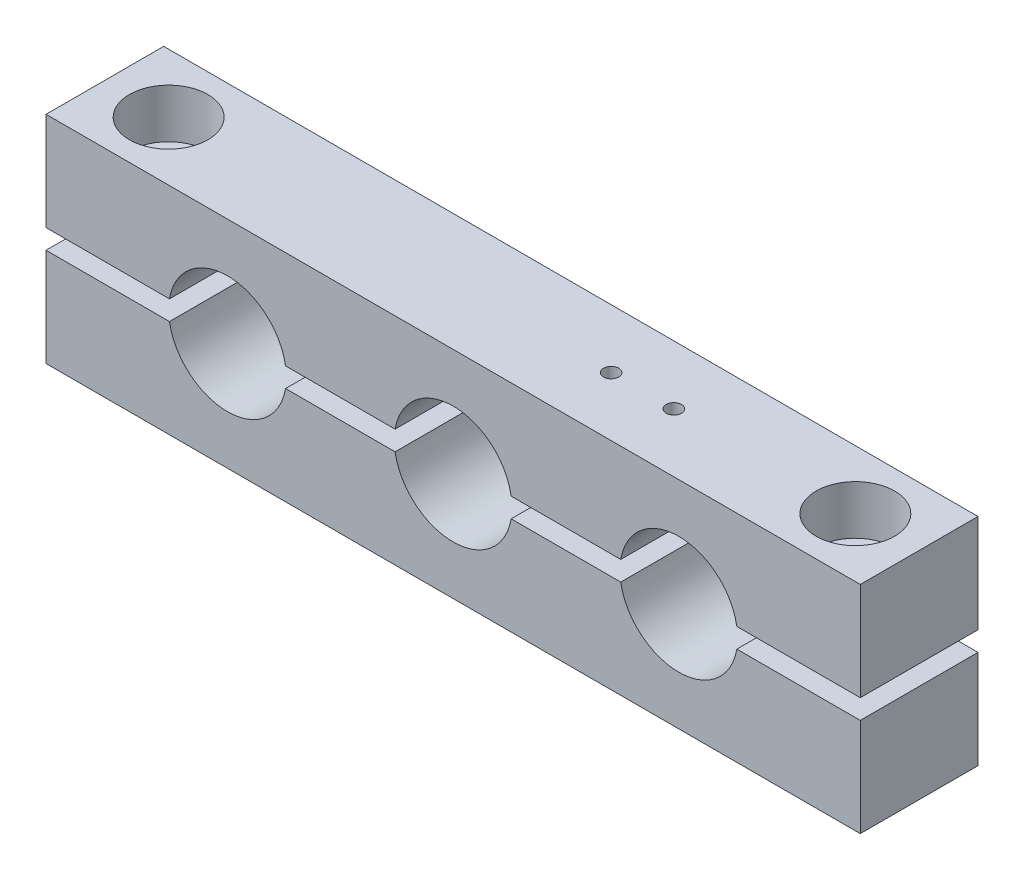
ISO-10303-21;
HEADER;
FILE_DESCRIPTION(('STEP AP214'),'2;1');
FILE_NAME('part.step','',(''),(''),'','','');
FILE_SCHEMA(('AUTOMOTIVE_DESIGN { 1 0 10303 214 1 1 1 1 }'));
ENDSEC;
DATA;
#1=APPLICATION_CONTEXT('core data for automotive mechanical design processes');
#2=APPLICATION_PROTOCOL_DEFINITION('international standard','automotive_design',2000,#1);
#3=PRODUCT_CONTEXT('',#1,'mechanical');
#4=PRODUCT('Part','Part','',(#3));
#5=PRODUCT_RELATED_PRODUCT_CATEGORY('part','',(#4));
#6=PRODUCT_DEFINITION_FORMATION('','',#4);
#7=PRODUCT_DEFINITION_CONTEXT('part definition',#1,'design');
#8=PRODUCT_DEFINITION('design','',#6,#7);
#9=PRODUCT_DEFINITION_SHAPE('','',#8);
#10=(LENGTH_UNIT() NAMED_UNIT(*) SI_UNIT(.MILLI.,.METRE.));
#11=(NAMED_UNIT(*) PLANE_ANGLE_UNIT() SI_UNIT($,.RADIAN.));
#12=(NAMED_UNIT(*) SI_UNIT($,.STERADIAN.) SOLID_ANGLE_UNIT());
#13=UNCERTAINTY_MEASURE_WITH_UNIT(LENGTH_MEASURE(1.E-05),#10,'distance_accuracy_value','');
#14=(GEOMETRIC_REPRESENTATION_CONTEXT(3) GLOBAL_UNCERTAINTY_ASSIGNED_CONTEXT((#13)) GLOBAL_UNIT_ASSIGNED_CONTEXT((#10,
#11,#12)) REPRESENTATION_CONTEXT('',''));
#15=CARTESIAN_POINT('',(0.,0.,0.));
#16=DIRECTION('',(0.,0.,1.));
#17=DIRECTION('',(1.,0.,0.));
#18=AXIS2_PLACEMENT_3D('',#15,#16,#17);
#19=CARTESIAN_POINT('',(35.,-11.,6.));
#20=DIRECTION('',(0.,1.,0.));
#21=DIRECTION('',(0.,0.,1.));
#22=AXIS2_PLACEMENT_3D('',#19,#20,#21);
#23=CYLINDRICAL_SURFACE('',#22,2.1);
#24=CARTESIAN_POINT('',(35.,0.999999999999999,6.));
#25=DIRECTION('',(0.,1.,0.));
#26=DIRECTION('',(0.,0.,1.));
#27=AXIS2_PLACEMENT_3D('',#24,#25,#26);
#28=CIRCLE('',#27,2.1);
#29=CARTESIAN_POINT('',(35.,0.999999999999999,8.1));
#30=VERTEX_POINT('',#29);
#31=EDGE_CURVE('E189',#30,#30,#28,.F.);
#32=ORIENTED_EDGE('',*,*,#31,.T.);
#33=EDGE_LOOP('',(#32));
#34=FACE_BOUND('',#33,.T.);
#35=CARTESIAN_POINT('',(35.,6.,6.));
#36=DIRECTION('',(0.,1.,0.));
#37=DIRECTION('',(0.,0.,1.));
#38=AXIS2_PLACEMENT_3D('',#35,#36,#37);
#39=CIRCLE('',#38,2.1);
#40=CARTESIAN_POINT('',(35.,6.,8.1));
#41=VERTEX_POINT('',#40);
#42=EDGE_CURVE('E217',#41,#41,#39,.F.);
#43=ORIENTED_EDGE('',*,*,#42,.F.);
#44=EDGE_LOOP('',(#43));
#45=FACE_BOUND('',#44,.T.);
#46=ADVANCED_FACE('F46',(#34,#45),#23,.F.);
#47=CARTESIAN_POINT('',(-35.,-11.,6.));
#48=DIRECTION('',(0.,1.,0.));
#49=DIRECTION('',(0.,0.,1.));
#50=AXIS2_PLACEMENT_3D('',#47,#48,#49);
#51=CYLINDRICAL_SURFACE('',#50,2.1);
#52=CARTESIAN_POINT('',(-35.,0.999999999999999,6.));
#53=DIRECTION('',(0.,1.,0.));
#54=DIRECTION('',(0.,0.,1.));
#55=AXIS2_PLACEMENT_3D('',#52,#53,#54);
#56=CIRCLE('',#55,2.1);
#57=CARTESIAN_POINT('',(-35.,0.999999999999999,8.1));
#58=VERTEX_POINT('',#57);
#59=EDGE_CURVE('E192',#58,#58,#56,.F.);
#60=ORIENTED_EDGE('',*,*,#59,.T.);
#61=EDGE_LOOP('',(#60));
#62=FACE_BOUND('',#61,.T.);
#63=CARTESIAN_POINT('',(-35.,6.,6.));
#64=DIRECTION('',(0.,1.,0.));
#65=DIRECTION('',(0.,0.,1.));
#66=AXIS2_PLACEMENT_3D('',#63,#64,#65);
#67=CIRCLE('',#66,2.1);
#68=CARTESIAN_POINT('',(-35.,6.,8.1));
#69=VERTEX_POINT('',#68);
#70=EDGE_CURVE('E179',#69,#69,#67,.F.);
#71=ORIENTED_EDGE('',*,*,#70,.F.);
#72=EDGE_LOOP('',(#71));
#73=FACE_BOUND('',#72,.T.);
#74=ADVANCED_FACE('F273',(#62,#73),#51,.F.);
#75=CARTESIAN_POINT('',(0.,0.,12.));
#76=DIRECTION('',(0.,0.,-1.));
#77=DIRECTION('',(-1.,0.,0.));
#78=AXIS2_PLACEMENT_3D('',#75,#76,#77);
#79=PLANE('',#78);
#80=DIRECTION('',(0.,-1.,0.));
#81=VECTOR('',#80,1.);
#82=CARTESIAN_POINT('',(-41.5,-11.,12.));
#83=LINE('',#82,#81);
#84=CARTESIAN_POINT('',(-41.5,11.,12.));
#85=VERTEX_POINT('',#84);
#86=CARTESIAN_POINT('',(-41.5,1.,12.));
#87=VERTEX_POINT('',#86);
#88=EDGE_CURVE('E196',#85,#87,#83,.T.);
#89=ORIENTED_EDGE('',*,*,#88,.T.);
#90=DIRECTION('',(-1.,0.,0.));
#91=VECTOR('',#90,1.);
#92=CARTESIAN_POINT('',(-48.1191983947229,1.,12.));
#93=LINE('',#92,#91);
#94=CARTESIAN_POINT('',(-28.9160797830996,1.,12.));
#95=VERTEX_POINT('',#94);
#96=EDGE_CURVE('E130',#95,#87,#93,.T.);
#97=ORIENTED_EDGE('',*,*,#96,.F.);
#98=CARTESIAN_POINT('',(-23.,0.,12.));
#99=DIRECTION('',(0.,0.,1.));
#100=DIRECTION('',(1.,0.,0.));
#101=AXIS2_PLACEMENT_3D('',#98,#99,#100);
#102=CIRCLE('',#101,6.);
#103=CARTESIAN_POINT('',(-17.0839202169004,1.,12.));
#104=VERTEX_POINT('',#103);
#105=EDGE_CURVE('E166',#104,#95,#102,.T.);
#106=ORIENTED_EDGE('',*,*,#105,.F.);
#107=CARTESIAN_POINT('',(-5.91607978309963,1.,12.));
#108=VERTEX_POINT('',#107);
#109=EDGE_CURVE('E56',#108,#104,#93,.T.);
#110=ORIENTED_EDGE('',*,*,#109,.F.);
#111=CARTESIAN_POINT('',(0.,0.,12.));
#112=DIRECTION('',(0.,0.,1.));
#113=DIRECTION('',(1.,0.,0.));
#114=AXIS2_PLACEMENT_3D('',#111,#112,#113);
#115=CIRCLE('',#114,6.);
#116=CARTESIAN_POINT('',(5.91607978309961,1.,12.));
#117=VERTEX_POINT('',#116);
#118=EDGE_CURVE('E163',#117,#108,#115,.T.);
#119=ORIENTED_EDGE('',*,*,#118,.F.);
#120=CARTESIAN_POINT('',(17.0839202169004,1.,12.));
#121=VERTEX_POINT('',#120);
#122=EDGE_CURVE('E247',#121,#117,#93,.T.);
#123=ORIENTED_EDGE('',*,*,#122,.F.);
#124=CARTESIAN_POINT('',(23.,0.,12.));
#125=DIRECTION('',(0.,0.,1.));
#126=DIRECTION('',(-1.,0.,0.));
#127=AXIS2_PLACEMENT_3D('',#124,#125,#126);
#128=CIRCLE('',#127,5.99999999999999);
#129=CARTESIAN_POINT('',(28.9160797830996,1.,12.));
#130=VERTEX_POINT('',#129);
#131=EDGE_CURVE('E172',#130,#121,#128,.T.);
#132=ORIENTED_EDGE('',*,*,#131,.F.);
#133=CARTESIAN_POINT('',(41.5,1.,12.));
#134=VERTEX_POINT('',#133);
#135=EDGE_CURVE('E207',#134,#130,#93,.T.);
#136=ORIENTED_EDGE('',*,*,#135,.F.);
#137=DIRECTION('',(0.,1.,0.));
#138=VECTOR('',#137,1.);
#139=CARTESIAN_POINT('',(41.5,-11.,12.));
#140=LINE('',#139,#138);
#141=CARTESIAN_POINT('',(41.5,11.,12.));
#142=VERTEX_POINT('',#141);
#143=EDGE_CURVE('E158',#134,#142,#140,.T.);
#144=ORIENTED_EDGE('',*,*,#143,.T.);
#145=DIRECTION('',(-1.,0.,0.));
#146=VECTOR('',#145,1.);
#147=CARTESIAN_POINT('',(-41.5,11.,12.));
#148=LINE('',#147,#146);
#149=EDGE_CURVE('E146',#142,#85,#148,.T.);
#150=ORIENTED_EDGE('',*,*,#149,.T.);
#151=EDGE_LOOP('',(#89,#97,#106,#110,#119,#123,#132,#136,#144,#150));
#152=FACE_BOUND('',#151,.T.);
#153=ADVANCED_FACE('F48',(#152),#79,.F.);
#154=CARTESIAN_POINT('',(0.,0.,0.));
#155=DIRECTION('',(0.,0.,-1.));
#156=DIRECTION('',(-1.,0.,0.));
#157=AXIS2_PLACEMENT_3D('',#154,#155,#156);
#158=PLANE('',#157);
#159=DIRECTION('',(-1.,0.,0.));
#160=VECTOR('',#159,1.);
#161=CARTESIAN_POINT('',(-48.1191983947229,1.,0.));
#162=LINE('',#161,#160);
#163=CARTESIAN_POINT('',(-28.9160797830996,1.,0.));
#164=VERTEX_POINT('',#163);
#165=CARTESIAN_POINT('',(-41.5,1.,0.));
#166=VERTEX_POINT('',#165);
#167=EDGE_CURVE('E127',#164,#166,#162,.T.);
#168=ORIENTED_EDGE('',*,*,#167,.T.);
#169=DIRECTION('',(0.,-1.,0.));
#170=VECTOR('',#169,1.);
#171=CARTESIAN_POINT('',(-41.5,-11.,0.));
#172=LINE('',#171,#170);
#173=CARTESIAN_POINT('',(-41.5,11.,0.));
#174=VERTEX_POINT('',#173);
#175=EDGE_CURVE('E136',#174,#166,#172,.T.);
#176=ORIENTED_EDGE('',*,*,#175,.F.);
#177=DIRECTION('',(-1.,0.,0.));
#178=VECTOR('',#177,1.);
#179=CARTESIAN_POINT('',(-41.5,11.,0.));
#180=LINE('',#179,#178);
#181=CARTESIAN_POINT('',(41.5,11.,0.));
#182=VERTEX_POINT('',#181);
#183=EDGE_CURVE('E154',#182,#174,#180,.T.);
#184=ORIENTED_EDGE('',*,*,#183,.F.);
#185=DIRECTION('',(0.,1.,0.));
#186=VECTOR('',#185,1.);
#187=CARTESIAN_POINT('',(41.5,-11.,0.));
#188=LINE('',#187,#186);
#189=CARTESIAN_POINT('',(41.5,1.,0.));
#190=VERTEX_POINT('',#189);
#191=EDGE_CURVE('E160',#190,#182,#188,.T.);
#192=ORIENTED_EDGE('',*,*,#191,.F.);
#193=CARTESIAN_POINT('',(28.9160797830996,1.,0.));
#194=VERTEX_POINT('',#193);
#195=EDGE_CURVE('E145',#190,#194,#162,.T.);
#196=ORIENTED_EDGE('',*,*,#195,.T.);
#197=CARTESIAN_POINT('',(23.,0.,0.));
#198=DIRECTION('',(0.,0.,1.));
#199=DIRECTION('',(-1.,0.,0.));
#200=AXIS2_PLACEMENT_3D('',#197,#198,#199);
#201=CIRCLE('',#200,5.99999999999999);
#202=CARTESIAN_POINT('',(17.0839202169004,1.,0.));
#203=VERTEX_POINT('',#202);
#204=EDGE_CURVE('E50',#194,#203,#201,.T.);
#205=ORIENTED_EDGE('',*,*,#204,.T.);
#206=CARTESIAN_POINT('',(5.91607978309961,1.,0.));
#207=VERTEX_POINT('',#206);
#208=EDGE_CURVE('E103',#203,#207,#162,.T.);
#209=ORIENTED_EDGE('',*,*,#208,.T.);
#210=CARTESIAN_POINT('',(0.,0.,0.));
#211=DIRECTION('',(0.,0.,1.));
#212=DIRECTION('',(1.,0.,0.));
#213=AXIS2_PLACEMENT_3D('',#210,#211,#212);
#214=CIRCLE('',#213,6.);
#215=CARTESIAN_POINT('',(-5.91607978309963,1.,0.));
#216=VERTEX_POINT('',#215);
#217=EDGE_CURVE('E167',#207,#216,#214,.T.);
#218=ORIENTED_EDGE('',*,*,#217,.T.);
#219=CARTESIAN_POINT('',(-17.0839202169004,1.,0.));
#220=VERTEX_POINT('',#219);
#221=EDGE_CURVE('E64',#216,#220,#162,.T.);
#222=ORIENTED_EDGE('',*,*,#221,.T.);
#223=CARTESIAN_POINT('',(-23.,0.,0.));
#224=DIRECTION('',(0.,0.,1.));
#225=DIRECTION('',(1.,0.,0.));
#226=AXIS2_PLACEMENT_3D('',#223,#224,#225);
#227=CIRCLE('',#226,6.);
#228=EDGE_CURVE('E144',#220,#164,#227,.T.);
#229=ORIENTED_EDGE('',*,*,#228,.T.);
#230=EDGE_LOOP('',(#168,#176,#184,#192,#196,#205,#209,#218,#222,#229));
#231=FACE_BOUND('',#230,.T.);
#232=ADVANCED_FACE('F141',(#231),#158,.T.);
#233=CARTESIAN_POINT('',(41.5,-11.,12.));
#234=DIRECTION('',(-1.,0.,0.));
#235=DIRECTION('',(0.,0.,1.));
#236=AXIS2_PLACEMENT_3D('',#233,#234,#235);
#237=PLANE('',#236);
#238=ORIENTED_EDGE('',*,*,#143,.F.);
#239=DIRECTION('',(0.,0.,-1.));
#240=VECTOR('',#239,1.);
#241=CARTESIAN_POINT('',(41.5,0.999999999999999,12.));
#242=LINE('',#241,#240);
#243=EDGE_CURVE('E162',#134,#190,#242,.T.);
#244=ORIENTED_EDGE('',*,*,#243,.T.);
#245=ORIENTED_EDGE('',*,*,#191,.T.);
#246=DIRECTION('',(0.,0.,-1.));
#247=VECTOR('',#246,1.);
#248=CARTESIAN_POINT('',(41.5,11.,12.));
#249=LINE('',#248,#247);
#250=EDGE_CURVE('E151',#142,#182,#249,.T.);
#251=ORIENTED_EDGE('',*,*,#250,.F.);
#252=EDGE_LOOP('',(#238,#244,#245,#251));
#253=FACE_BOUND('',#252,.T.);
#254=ADVANCED_FACE('F232',(#253),#237,.F.);
#255=CARTESIAN_POINT('',(-41.5,11.,12.));
#256=DIRECTION('',(0.,-1.,0.));
#257=DIRECTION('',(0.,0.,-1.));
#258=AXIS2_PLACEMENT_3D('',#255,#256,#257);
#259=PLANE('',#258);
#260=CARTESIAN_POINT('',(16.5,11.,6.));
#261=DIRECTION('',(0.,1.,0.));
#262=DIRECTION('',(0.,0.,1.));
#263=AXIS2_PLACEMENT_3D('',#260,#261,#262);
#264=CIRCLE('',#263,0.779999999999999);
#265=CARTESIAN_POINT('',(16.5,11.,6.78));
#266=VERTEX_POINT('',#265);
#267=EDGE_CURVE('E317',#266,#266,#264,.T.);
#268=ORIENTED_EDGE('',*,*,#267,.F.);
#269=EDGE_LOOP('',(#268));
#270=FACE_BOUND('',#269,.T.);
#271=CARTESIAN_POINT('',(10.1,11.,6.00000000000001));
#272=DIRECTION('',(0.,1.,0.));
#273=DIRECTION('',(0.,0.,1.));
#274=AXIS2_PLACEMENT_3D('',#271,#272,#273);
#275=CIRCLE('',#274,0.779999999999999);
#276=CARTESIAN_POINT('',(10.1,11.,6.78));
#277=VERTEX_POINT('',#276);
#278=EDGE_CURVE('E325',#277,#277,#275,.T.);
#279=ORIENTED_EDGE('',*,*,#278,.F.);
#280=EDGE_LOOP('',(#279));
#281=FACE_BOUND('',#280,.T.);
#282=CARTESIAN_POINT('',(-35.,11.,6.));
#283=DIRECTION('',(0.,1.,0.));
#284=DIRECTION('',(0.,0.,1.));
#285=AXIS2_PLACEMENT_3D('',#282,#283,#284);
#286=CIRCLE('',#285,4.);
#287=CARTESIAN_POINT('',(-35.,11.,10.));
#288=VERTEX_POINT('',#287);
#289=EDGE_CURVE('E184',#288,#288,#286,.T.);
#290=ORIENTED_EDGE('',*,*,#289,.F.);
#291=EDGE_LOOP('',(#290));
#292=FACE_BOUND('',#291,.T.);
#293=CARTESIAN_POINT('',(35.,11.,6.));
#294=DIRECTION('',(0.,1.,0.));
#295=DIRECTION('',(0.,0.,1.));
#296=AXIS2_PLACEMENT_3D('',#293,#294,#295);
#297=CIRCLE('',#296,4.00000000000001);
#298=CARTESIAN_POINT('',(35.,11.,10.));
#299=VERTEX_POINT('',#298);
#300=EDGE_CURVE('E201',#299,#299,#297,.T.);
#301=ORIENTED_EDGE('',*,*,#300,.F.);
#302=EDGE_LOOP('',(#301));
#303=FACE_BOUND('',#302,.T.);
#304=ORIENTED_EDGE('',*,*,#183,.T.);
#305=DIRECTION('',(0.,0.,-1.));
#306=VECTOR('',#305,1.);
#307=CARTESIAN_POINT('',(-41.5,11.,12.));
#308=LINE('',#307,#306);
#309=EDGE_CURVE('E135',#85,#174,#308,.T.);
#310=ORIENTED_EDGE('',*,*,#309,.F.);
#311=ORIENTED_EDGE('',*,*,#149,.F.);
#312=ORIENTED_EDGE('',*,*,#250,.T.);
#313=EDGE_LOOP('',(#304,#310,#311,#312));
#314=FACE_BOUND('',#313,.T.);
#315=ADVANCED_FACE('F229',(#270,#281,#292,#303,#314),#259,.F.);
#316=CARTESIAN_POINT('',(-41.5,-11.,12.));
#317=DIRECTION('',(1.,0.,0.));
#318=DIRECTION('',(0.,0.,-1.));
#319=AXIS2_PLACEMENT_3D('',#316,#317,#318);
#320=PLANE('',#319);
#321=ORIENTED_EDGE('',*,*,#175,.T.);
#322=DIRECTION('',(0.,0.,1.));
#323=VECTOR('',#322,1.);
#324=CARTESIAN_POINT('',(-41.5,0.999999999999999,12.));
#325=LINE('',#324,#323);
#326=EDGE_CURVE('E123',#166,#87,#325,.T.);
#327=ORIENTED_EDGE('',*,*,#326,.T.);
#328=ORIENTED_EDGE('',*,*,#88,.F.);
#329=ORIENTED_EDGE('',*,*,#309,.T.);
#330=EDGE_LOOP('',(#321,#327,#328,#329));
#331=FACE_BOUND('',#330,.T.);
#332=ADVANCED_FACE('F149',(#331),#320,.F.);
#333=CARTESIAN_POINT('',(0.,0.,12.));
#334=DIRECTION('',(0.,0.,-1.));
#335=DIRECTION('',(-1.,0.,0.));
#336=AXIS2_PLACEMENT_3D('',#333,#334,#335);
#337=CYLINDRICAL_SURFACE('',#336,6.);
#338=DIRECTION('',(0.,0.,-1.));
#339=VECTOR('',#338,1.);
#340=CARTESIAN_POINT('',(5.91607978309961,1.,12.));
#341=LINE('',#340,#339);
#342=EDGE_CURVE('E199',#117,#207,#341,.T.);
#343=ORIENTED_EDGE('',*,*,#342,.F.);
#344=ORIENTED_EDGE('',*,*,#118,.T.);
#345=DIRECTION('',(0.,0.,-1.));
#346=VECTOR('',#345,1.);
#347=CARTESIAN_POINT('',(-5.91607978309963,1.,12.));
#348=LINE('',#347,#346);
#349=EDGE_CURVE('E202',#216,#108,#348,.F.);
#350=ORIENTED_EDGE('',*,*,#349,.F.);
#351=ORIENTED_EDGE('',*,*,#217,.F.);
#352=EDGE_LOOP('',(#343,#344,#350,#351));
#353=FACE_BOUND('',#352,.T.);
#354=ADVANCED_FACE('F261',(#353),#337,.F.);
#355=CARTESIAN_POINT('',(-23.,0.,12.));
#356=DIRECTION('',(0.,0.,-1.));
#357=DIRECTION('',(-1.,0.,0.));
#358=AXIS2_PLACEMENT_3D('',#355,#356,#357);
#359=CYLINDRICAL_SURFACE('',#358,6.);
#360=DIRECTION('',(0.,0.,-1.));
#361=VECTOR('',#360,1.);
#362=CARTESIAN_POINT('',(-17.0839202169004,1.,12.));
#363=LINE('',#362,#361);
#364=EDGE_CURVE('E12',#104,#220,#363,.T.);
#365=ORIENTED_EDGE('',*,*,#364,.F.);
#366=ORIENTED_EDGE('',*,*,#105,.T.);
#367=DIRECTION('',(0.,0.,-1.));
#368=VECTOR('',#367,1.);
#369=CARTESIAN_POINT('',(-28.9160797830996,1.,12.));
#370=LINE('',#369,#368);
#371=EDGE_CURVE('E204',#164,#95,#370,.F.);
#372=ORIENTED_EDGE('',*,*,#371,.F.);
#373=ORIENTED_EDGE('',*,*,#228,.F.);
#374=EDGE_LOOP('',(#365,#366,#372,#373));
#375=FACE_BOUND('',#374,.T.);
#376=ADVANCED_FACE('F258',(#375),#359,.F.);
#377=CARTESIAN_POINT('',(23.,0.,12.));
#378=DIRECTION('',(0.,0.,-1.));
#379=DIRECTION('',(-1.,0.,0.));
#380=AXIS2_PLACEMENT_3D('',#377,#378,#379);
#381=CYLINDRICAL_SURFACE('',#380,5.99999999999999);
#382=DIRECTION('',(0.,0.,-1.));
#383=VECTOR('',#382,1.);
#384=CARTESIAN_POINT('',(28.9160797830996,1.,12.));
#385=LINE('',#384,#383);
#386=EDGE_CURVE('E206',#130,#194,#385,.T.);
#387=ORIENTED_EDGE('',*,*,#386,.F.);
#388=ORIENTED_EDGE('',*,*,#131,.T.);
#389=DIRECTION('',(0.,0.,-1.));
#390=VECTOR('',#389,1.);
#391=CARTESIAN_POINT('',(17.0839202169004,1.,12.));
#392=LINE('',#391,#390);
#393=EDGE_CURVE('E99',#203,#121,#392,.F.);
#394=ORIENTED_EDGE('',*,*,#393,.F.);
#395=ORIENTED_EDGE('',*,*,#204,.F.);
#396=EDGE_LOOP('',(#387,#388,#394,#395));
#397=FACE_BOUND('',#396,.T.);
#398=ADVANCED_FACE('F260',(#397),#381,.F.);
#399=CARTESIAN_POINT('',(-35.,6.,6.));
#400=DIRECTION('',(0.,1.,0.));
#401=DIRECTION('',(0.,0.,1.));
#402=AXIS2_PLACEMENT_3D('',#399,#400,#401);
#403=PLANE('',#402);
#404=CARTESIAN_POINT('',(-35.,6.,6.));
#405=DIRECTION('',(0.,1.,0.));
#406=DIRECTION('',(0.,0.,1.));
#407=AXIS2_PLACEMENT_3D('',#404,#405,#406);
#408=CIRCLE('',#407,4.);
#409=CARTESIAN_POINT('',(-35.,6.,10.));
#410=VERTEX_POINT('',#409);
#411=EDGE_CURVE('E174',#410,#410,#408,.T.);
#412=ORIENTED_EDGE('',*,*,#411,.T.);
#413=EDGE_LOOP('',(#412));
#414=FACE_BOUND('',#413,.T.);
#415=ORIENTED_EDGE('',*,*,#70,.T.);
#416=EDGE_LOOP('',(#415));
#417=FACE_BOUND('',#416,.T.);
#418=ADVANCED_FACE('F267',(#414,#417),#403,.T.);
#419=CARTESIAN_POINT('',(-35.,6.,6.));
#420=DIRECTION('',(0.,1.,0.));
#421=DIRECTION('',(0.,0.,1.));
#422=AXIS2_PLACEMENT_3D('',#419,#420,#421);
#423=CYLINDRICAL_SURFACE('',#422,4.);
#424=ORIENTED_EDGE('',*,*,#411,.F.);
#425=EDGE_LOOP('',(#424));
#426=FACE_BOUND('',#425,.T.);
#427=ORIENTED_EDGE('',*,*,#289,.T.);
#428=EDGE_LOOP('',(#427));
#429=FACE_BOUND('',#428,.T.);
#430=ADVANCED_FACE('F227',(#426,#429),#423,.F.);
#431=CARTESIAN_POINT('',(35.,6.,6.));
#432=DIRECTION('',(0.,1.,0.));
#433=DIRECTION('',(0.,0.,1.));
#434=AXIS2_PLACEMENT_3D('',#431,#432,#433);
#435=PLANE('',#434);
#436=CARTESIAN_POINT('',(35.,6.,6.));
#437=DIRECTION('',(0.,1.,0.));
#438=DIRECTION('',(0.,0.,1.));
#439=AXIS2_PLACEMENT_3D('',#436,#437,#438);
#440=CIRCLE('',#439,4.00000000000001);
#441=CARTESIAN_POINT('',(35.,6.,10.));
#442=VERTEX_POINT('',#441);
#443=EDGE_CURVE('E218',#442,#442,#440,.T.);
#444=ORIENTED_EDGE('',*,*,#443,.T.);
#445=EDGE_LOOP('',(#444));
#446=FACE_BOUND('',#445,.T.);
#447=ORIENTED_EDGE('',*,*,#42,.T.);
#448=EDGE_LOOP('',(#447));
#449=FACE_BOUND('',#448,.T.);
#450=ADVANCED_FACE('F290',(#446,#449),#435,.T.);
#451=CARTESIAN_POINT('',(35.,6.,6.));
#452=DIRECTION('',(0.,1.,0.));
#453=DIRECTION('',(0.,0.,1.));
#454=AXIS2_PLACEMENT_3D('',#451,#452,#453);
#455=CYLINDRICAL_SURFACE('',#454,4.00000000000001);
#456=ORIENTED_EDGE('',*,*,#443,.F.);
#457=EDGE_LOOP('',(#456));
#458=FACE_BOUND('',#457,.T.);
#459=ORIENTED_EDGE('',*,*,#300,.T.);
#460=EDGE_LOOP('',(#459));
#461=FACE_BOUND('',#460,.T.);
#462=ADVANCED_FACE('F294',(#458,#461),#455,.F.);
#463=CARTESIAN_POINT('',(-48.1191983947229,1.,0.));
#464=DIRECTION('',(0.,1.,0.));
#465=DIRECTION('',(0.,0.,1.));
#466=AXIS2_PLACEMENT_3D('',#463,#464,#465);
#467=PLANE('',#466);
#468=ORIENTED_EDGE('',*,*,#342,.T.);
#469=ORIENTED_EDGE('',*,*,#208,.F.);
#470=ORIENTED_EDGE('',*,*,#393,.T.);
#471=ORIENTED_EDGE('',*,*,#122,.T.);
#472=EDGE_LOOP('',(#468,#469,#470,#471));
#473=FACE_BOUND('',#472,.T.);
#474=ADVANCED_FACE('F285',(#473),#467,.F.);
#475=ORIENTED_EDGE('',*,*,#135,.T.);
#476=ORIENTED_EDGE('',*,*,#386,.T.);
#477=ORIENTED_EDGE('',*,*,#195,.F.);
#478=ORIENTED_EDGE('',*,*,#243,.F.);
#479=EDGE_LOOP('',(#475,#476,#477,#478));
#480=FACE_BOUND('',#479,.T.);
#481=ORIENTED_EDGE('',*,*,#31,.F.);
#482=EDGE_LOOP('',(#481));
#483=FACE_BOUND('',#482,.T.);
#484=ADVANCED_FACE('F245',(#480,#483),#467,.F.);
#485=ORIENTED_EDGE('',*,*,#167,.F.);
#486=ORIENTED_EDGE('',*,*,#371,.T.);
#487=ORIENTED_EDGE('',*,*,#96,.T.);
#488=ORIENTED_EDGE('',*,*,#326,.F.);
#489=EDGE_LOOP('',(#485,#486,#487,#488));
#490=FACE_BOUND('',#489,.T.);
#491=ORIENTED_EDGE('',*,*,#59,.F.);
#492=EDGE_LOOP('',(#491));
#493=FACE_BOUND('',#492,.T.);
#494=ADVANCED_FACE('F125',(#490,#493),#467,.F.);
#495=ORIENTED_EDGE('',*,*,#349,.T.);
#496=ORIENTED_EDGE('',*,*,#109,.T.);
#497=ORIENTED_EDGE('',*,*,#364,.T.);
#498=ORIENTED_EDGE('',*,*,#221,.F.);
#499=EDGE_LOOP('',(#495,#496,#497,#498));
#500=FACE_BOUND('',#499,.T.);
#501=ADVANCED_FACE('F254',(#500),#467,.F.);
#502=CARTESIAN_POINT('',(10.1,3.,6.00000000000001));
#503=DIRECTION('',(0.,1.,0.));
#504=DIRECTION('',(0.,0.,1.));
#505=AXIS2_PLACEMENT_3D('',#502,#503,#504);
#506=CYLINDRICAL_SURFACE('',#505,0.779999999999999);
#507=CARTESIAN_POINT('',(10.1,3.,6.00000000000001));
#508=DIRECTION('',(0.,1.,0.));
#509=DIRECTION('',(0.,0.,1.));
#510=AXIS2_PLACEMENT_3D('',#507,#508,#509);
#511=CIRCLE('',#510,0.779999999999999);
#512=CARTESIAN_POINT('',(10.1,3.,6.78));
#513=VERTEX_POINT('',#512);
#514=EDGE_CURVE('E320',#513,#513,#511,.T.);
#515=ORIENTED_EDGE('',*,*,#514,.F.);
#516=EDGE_LOOP('',(#515));
#517=FACE_BOUND('',#516,.T.);
#518=ORIENTED_EDGE('',*,*,#278,.T.);
#519=EDGE_LOOP('',(#518));
#520=FACE_BOUND('',#519,.T.);
#521=ADVANCED_FACE('F298',(#517,#520),#506,.F.);
#522=CARTESIAN_POINT('',(10.1,3.,6.00000000000001));
#523=DIRECTION('',(0.,1.,0.));
#524=DIRECTION('',(0.,0.,1.));
#525=AXIS2_PLACEMENT_3D('',#522,#523,#524);
#526=PLANE('',#525);
#527=ORIENTED_EDGE('',*,*,#514,.T.);
#528=EDGE_LOOP('',(#527));
#529=FACE_BOUND('',#528,.T.);
#530=ADVANCED_FACE('F301',(#529),#526,.T.);
#531=CARTESIAN_POINT('',(16.5,3.,6.));
#532=DIRECTION('',(0.,1.,0.));
#533=DIRECTION('',(0.,0.,1.));
#534=AXIS2_PLACEMENT_3D('',#531,#532,#533);
#535=CYLINDRICAL_SURFACE('',#534,0.779999999999999);
#536=CARTESIAN_POINT('',(16.5,3.,6.));
#537=DIRECTION('',(0.,1.,0.));
#538=DIRECTION('',(0.,0.,1.));
#539=AXIS2_PLACEMENT_3D('',#536,#537,#538);
#540=CIRCLE('',#539,0.779999999999999);
#541=CARTESIAN_POINT('',(16.5,3.,6.78));
#542=VERTEX_POINT('',#541);
#543=EDGE_CURVE('E193',#542,#542,#540,.T.);
#544=ORIENTED_EDGE('',*,*,#543,.F.);
#545=EDGE_LOOP('',(#544));
#546=FACE_BOUND('',#545,.T.);
#547=ORIENTED_EDGE('',*,*,#267,.T.);
#548=EDGE_LOOP('',(#547));
#549=FACE_BOUND('',#548,.T.);
#550=ADVANCED_FACE('F305',(#546,#549),#535,.F.);
#551=CARTESIAN_POINT('',(16.5,3.,6.));
#552=DIRECTION('',(0.,1.,0.));
#553=DIRECTION('',(0.,0.,1.));
#554=AXIS2_PLACEMENT_3D('',#551,#552,#553);
#555=PLANE('',#554);
#556=ORIENTED_EDGE('',*,*,#543,.T.);
#557=EDGE_LOOP('',(#556));
#558=FACE_BOUND('',#557,.T.);
#559=ADVANCED_FACE('F309',(#558),#555,.T.);
#560=CLOSED_SHELL('',(#46,#74,#153,#232,#254,#315,#332,#354,#376,#398,#418,#430,#450,#462,#474,
#484,#494,#501,#521,#530,#550,#559));
#561=MANIFOLD_SOLID_BREP('B2',#560);
#562=CARTESIAN_POINT('',(35.,-11.,6.));
#563=DIRECTION('',(0.,1.,0.));
#564=DIRECTION('',(0.,0.,1.));
#565=AXIS2_PLACEMENT_3D('',#562,#563,#564);
#566=CYLINDRICAL_SURFACE('',#565,2.1);
#567=CARTESIAN_POINT('',(35.,-0.999999999999999,6.));
#568=DIRECTION('',(0.,-1.,0.));
#569=DIRECTION('',(0.,0.,-1.));
#570=AXIS2_PLACEMENT_3D('',#567,#568,#569);
#571=CIRCLE('',#570,2.1);
#572=CARTESIAN_POINT('',(35.,-0.999999999999999,3.9));
#573=VERTEX_POINT('',#572);
#574=EDGE_CURVE('E654',#573,#573,#571,.F.);
#575=ORIENTED_EDGE('',*,*,#574,.T.);
#576=EDGE_LOOP('',(#575));
#577=FACE_BOUND('',#576,.T.);
#578=CARTESIAN_POINT('',(35.,-11.,6.));
#579=DIRECTION('',(0.,1.,0.));
#580=DIRECTION('',(0.,0.,-1.));
#581=AXIS2_PLACEMENT_3D('',#578,#579,#580);
#582=CIRCLE('',#581,2.1);
#583=CARTESIAN_POINT('',(35.,-11.,3.9));
#584=VERTEX_POINT('',#583);
#585=EDGE_CURVE('E624',#584,#584,#582,.T.);
#586=ORIENTED_EDGE('',*,*,#585,.F.);
#587=EDGE_LOOP('',(#586));
#588=FACE_BOUND('',#587,.T.);
#589=ADVANCED_FACE('F478',(#577,#588),#566,.F.);
#590=CARTESIAN_POINT('',(-35.,-11.,6.));
#591=DIRECTION('',(0.,1.,0.));
#592=DIRECTION('',(0.,0.,1.));
#593=AXIS2_PLACEMENT_3D('',#590,#591,#592);
#594=CYLINDRICAL_SURFACE('',#593,2.1);
#595=CARTESIAN_POINT('',(-35.,-0.999999999999999,6.));
#596=DIRECTION('',(0.,-1.,0.));
#597=DIRECTION('',(0.,0.,-1.));
#598=AXIS2_PLACEMENT_3D('',#595,#596,#597);
#599=CIRCLE('',#598,2.1);
#600=CARTESIAN_POINT('',(-35.,-0.999999999999999,3.9));
#601=VERTEX_POINT('',#600);
#602=EDGE_CURVE('E651',#601,#601,#599,.F.);
#603=ORIENTED_EDGE('',*,*,#602,.T.);
#604=EDGE_LOOP('',(#603));
#605=FACE_BOUND('',#604,.T.);
#606=CARTESIAN_POINT('',(-35.,-11.,6.));
#607=DIRECTION('',(0.,1.,0.));
#608=DIRECTION('',(0.,0.,1.));
#609=AXIS2_PLACEMENT_3D('',#606,#607,#608);
#610=CIRCLE('',#609,2.1);
#611=CARTESIAN_POINT('',(-35.,-11.,8.1));
#612=VERTEX_POINT('',#611);
#613=EDGE_CURVE('E621',#612,#612,#610,.T.);
#614=ORIENTED_EDGE('',*,*,#613,.F.);
#615=EDGE_LOOP('',(#614));
#616=FACE_BOUND('',#615,.T.);
#617=ADVANCED_FACE('F666',(#605,#616),#594,.F.);
#618=CARTESIAN_POINT('',(-41.5,-11.,12.));
#619=DIRECTION('',(0.,1.,0.));
#620=DIRECTION('',(0.,0.,1.));
#621=AXIS2_PLACEMENT_3D('',#618,#619,#620);
#622=PLANE('',#621);
#623=ORIENTED_EDGE('',*,*,#613,.T.);
#624=EDGE_LOOP('',(#623));
#625=FACE_BOUND('',#624,.T.);
#626=ORIENTED_EDGE('',*,*,#585,.T.);
#627=EDGE_LOOP('',(#626));
#628=FACE_BOUND('',#627,.T.);
#629=DIRECTION('',(1.,0.,0.));
#630=VECTOR('',#629,1.);
#631=CARTESIAN_POINT('',(-41.5,-11.,0.));
#632=LINE('',#631,#630);
#633=CARTESIAN_POINT('',(-41.5,-11.,0.));
#634=VERTEX_POINT('',#633);
#635=CARTESIAN_POINT('',(41.5,-11.,0.));
#636=VERTEX_POINT('',#635);
#637=EDGE_CURVE('E585',#634,#636,#632,.T.);
#638=ORIENTED_EDGE('',*,*,#637,.T.);
#639=DIRECTION('',(0.,0.,-1.));
#640=VECTOR('',#639,1.);
#641=CARTESIAN_POINT('',(41.5,-11.,12.));
#642=LINE('',#641,#640);
#643=CARTESIAN_POINT('',(41.5,-11.,12.));
#644=VERTEX_POINT('',#643);
#645=EDGE_CURVE('E583',#644,#636,#642,.T.);
#646=ORIENTED_EDGE('',*,*,#645,.F.);
#647=DIRECTION('',(1.,0.,0.));
#648=VECTOR('',#647,1.);
#649=CARTESIAN_POINT('',(-41.5,-11.,12.));
#650=LINE('',#649,#648);
#651=CARTESIAN_POINT('',(-41.5,-11.,12.));
#652=VERTEX_POINT('',#651);
#653=EDGE_CURVE('E580',#652,#644,#650,.T.);
#654=ORIENTED_EDGE('',*,*,#653,.F.);
#655=DIRECTION('',(0.,0.,-1.));
#656=VECTOR('',#655,1.);
#657=CARTESIAN_POINT('',(-41.5,-11.,12.));
#658=LINE('',#657,#656);
#659=EDGE_CURVE('E578',#652,#634,#658,.T.);
#660=ORIENTED_EDGE('',*,*,#659,.T.);
#661=EDGE_LOOP('',(#638,#646,#654,#660));
#662=FACE_BOUND('',#661,.T.);
#663=ADVANCED_FACE('F662',(#625,#628,#662),#622,.F.);
#664=CARTESIAN_POINT('',(23.,0.,12.));
#665=DIRECTION('',(0.,0.,-1.));
#666=DIRECTION('',(-1.,0.,0.));
#667=AXIS2_PLACEMENT_3D('',#664,#665,#666);
#668=CYLINDRICAL_SURFACE('',#667,5.99999999999999);
#669=DIRECTION('',(0.,0.,-1.));
#670=VECTOR('',#669,1.);
#671=CARTESIAN_POINT('',(17.0839202169004,-1.,12.));
#672=LINE('',#671,#670);
#673=CARTESIAN_POINT('',(17.0839202169004,-1.,12.));
#674=VERTEX_POINT('',#673);
#675=CARTESIAN_POINT('',(17.0839202169004,-1.,0.));
#676=VERTEX_POINT('',#675);
#677=EDGE_CURVE('E44',#674,#676,#672,.T.);
#678=ORIENTED_EDGE('',*,*,#677,.F.);
#679=CARTESIAN_POINT('',(23.,0.,12.));
#680=DIRECTION('',(0.,0.,1.));
#681=DIRECTION('',(-1.,0.,0.));
#682=AXIS2_PLACEMENT_3D('',#679,#680,#681);
#683=CIRCLE('',#682,5.99999999999999);
#684=CARTESIAN_POINT('',(28.9160797830996,-1.,12.));
#685=VERTEX_POINT('',#684);
#686=EDGE_CURVE('E611',#674,#685,#683,.T.);
#687=ORIENTED_EDGE('',*,*,#686,.T.);
#688=DIRECTION('',(0.,0.,-1.));
#689=VECTOR('',#688,1.);
#690=CARTESIAN_POINT('',(28.9160797830996,-1.,12.));
#691=LINE('',#690,#689);
#692=CARTESIAN_POINT('',(28.9160797830996,-1.,0.));
#693=VERTEX_POINT('',#692);
#694=EDGE_CURVE('E486',#693,#685,#691,.F.);
#695=ORIENTED_EDGE('',*,*,#694,.F.);
#696=CARTESIAN_POINT('',(23.,0.,0.));
#697=DIRECTION('',(0.,0.,1.));
#698=DIRECTION('',(-1.,0.,0.));
#699=AXIS2_PLACEMENT_3D('',#696,#697,#698);
#700=CIRCLE('',#699,5.99999999999999);
#701=EDGE_CURVE('E617',#676,#693,#700,.T.);
#702=ORIENTED_EDGE('',*,*,#701,.F.);
#703=EDGE_LOOP('',(#678,#687,#695,#702));
#704=FACE_BOUND('',#703,.T.);
#705=ADVANCED_FACE('F615',(#704),#668,.F.);
#706=CARTESIAN_POINT('',(0.,0.,12.));
#707=DIRECTION('',(0.,0.,-1.));
#708=DIRECTION('',(-1.,0.,0.));
#709=AXIS2_PLACEMENT_3D('',#706,#707,#708);
#710=CYLINDRICAL_SURFACE('',#709,6.);
#711=DIRECTION('',(0.,0.,-1.));
#712=VECTOR('',#711,1.);
#713=CARTESIAN_POINT('',(-5.91607978309963,-1.,12.));
#714=LINE('',#713,#712);
#715=CARTESIAN_POINT('',(-5.91607978309963,-1.,12.));
#716=VERTEX_POINT('',#715);
#717=CARTESIAN_POINT('',(-5.91607978309963,-1.,0.));
#718=VERTEX_POINT('',#717);
#719=EDGE_CURVE('E561',#716,#718,#714,.T.);
#720=ORIENTED_EDGE('',*,*,#719,.F.);
#721=CARTESIAN_POINT('',(0.,0.,12.));
#722=DIRECTION('',(0.,0.,1.));
#723=DIRECTION('',(1.,0.,0.));
#724=AXIS2_PLACEMENT_3D('',#721,#722,#723);
#725=CIRCLE('',#724,6.);
#726=CARTESIAN_POINT('',(5.91607978309961,-1.,12.));
#727=VERTEX_POINT('',#726);
#728=EDGE_CURVE('E593',#716,#727,#725,.T.);
#729=ORIENTED_EDGE('',*,*,#728,.T.);
#730=DIRECTION('',(0.,0.,-1.));
#731=VECTOR('',#730,1.);
#732=CARTESIAN_POINT('',(5.91607978309961,-1.,12.));
#733=LINE('',#732,#731);
#734=CARTESIAN_POINT('',(5.91607978309961,-1.,0.));
#735=VERTEX_POINT('',#734);
#736=EDGE_CURVE('E641',#735,#727,#733,.F.);
#737=ORIENTED_EDGE('',*,*,#736,.F.);
#738=CARTESIAN_POINT('',(0.,0.,0.));
#739=DIRECTION('',(0.,0.,1.));
#740=DIRECTION('',(1.,0.,0.));
#741=AXIS2_PLACEMENT_3D('',#738,#739,#740);
#742=CIRCLE('',#741,6.);
#743=EDGE_CURVE('E627',#718,#735,#742,.T.);
#744=ORIENTED_EDGE('',*,*,#743,.F.);
#745=EDGE_LOOP('',(#720,#729,#737,#744));
#746=FACE_BOUND('',#745,.T.);
#747=ADVANCED_FACE('F639',(#746),#710,.F.);
#748=CARTESIAN_POINT('',(-23.,0.,12.));
#749=DIRECTION('',(0.,0.,-1.));
#750=DIRECTION('',(-1.,0.,0.));
#751=AXIS2_PLACEMENT_3D('',#748,#749,#750);
#752=CYLINDRICAL_SURFACE('',#751,6.);
#753=DIRECTION('',(0.,0.,-1.));
#754=VECTOR('',#753,1.);
#755=CARTESIAN_POINT('',(-28.9160797830996,-1.,12.));
#756=LINE('',#755,#754);
#757=CARTESIAN_POINT('',(-28.9160797830996,-1.,12.));
#758=VERTEX_POINT('',#757);
#759=CARTESIAN_POINT('',(-28.9160797830996,-1.,0.));
#760=VERTEX_POINT('',#759);
#761=EDGE_CURVE('E643',#758,#760,#756,.T.);
#762=ORIENTED_EDGE('',*,*,#761,.F.);
#763=CARTESIAN_POINT('',(-23.,0.,12.));
#764=DIRECTION('',(0.,0.,1.));
#765=DIRECTION('',(1.,0.,0.));
#766=AXIS2_PLACEMENT_3D('',#763,#764,#765);
#767=CIRCLE('',#766,6.);
#768=CARTESIAN_POINT('',(-17.0839202169004,-1.,12.));
#769=VERTEX_POINT('',#768);
#770=EDGE_CURVE('E571',#758,#769,#767,.T.);
#771=ORIENTED_EDGE('',*,*,#770,.T.);
#772=DIRECTION('',(0.,0.,-1.));
#773=VECTOR('',#772,1.);
#774=CARTESIAN_POINT('',(-17.0839202169004,-1.,12.));
#775=LINE('',#774,#773);
#776=CARTESIAN_POINT('',(-17.0839202169004,-1.,0.));
#777=VERTEX_POINT('',#776);
#778=EDGE_CURVE('E646',#777,#769,#775,.F.);
#779=ORIENTED_EDGE('',*,*,#778,.F.);
#780=CARTESIAN_POINT('',(-23.,0.,0.));
#781=DIRECTION('',(0.,0.,1.));
#782=DIRECTION('',(1.,0.,0.));
#783=AXIS2_PLACEMENT_3D('',#780,#781,#782);
#784=CIRCLE('',#783,6.);
#785=EDGE_CURVE('E616',#760,#777,#784,.T.);
#786=ORIENTED_EDGE('',*,*,#785,.F.);
#787=EDGE_LOOP('',(#762,#771,#779,#786));
#788=FACE_BOUND('',#787,.T.);
#789=ADVANCED_FACE('F678',(#788),#752,.F.);
#790=CARTESIAN_POINT('',(-41.5,-11.,12.));
#791=DIRECTION('',(1.,0.,0.));
#792=DIRECTION('',(0.,0.,-1.));
#793=AXIS2_PLACEMENT_3D('',#790,#791,#792);
#794=PLANE('',#793);
#795=DIRECTION('',(0.,-1.,0.));
#796=VECTOR('',#795,1.);
#797=CARTESIAN_POINT('',(-41.5,-11.,12.));
#798=LINE('',#797,#796);
#799=CARTESIAN_POINT('',(-41.5,-1.,12.));
#800=VERTEX_POINT('',#799);
#801=EDGE_CURVE('E567',#800,#652,#798,.T.);
#802=ORIENTED_EDGE('',*,*,#801,.F.);
#803=DIRECTION('',(0.,0.,-1.));
#804=VECTOR('',#803,1.);
#805=CARTESIAN_POINT('',(-41.5,-0.999999999999999,12.));
#806=LINE('',#805,#804);
#807=CARTESIAN_POINT('',(-41.5,-1.,0.));
#808=VERTEX_POINT('',#807);
#809=EDGE_CURVE('E552',#800,#808,#806,.T.);
#810=ORIENTED_EDGE('',*,*,#809,.T.);
#811=DIRECTION('',(0.,-1.,0.));
#812=VECTOR('',#811,1.);
#813=CARTESIAN_POINT('',(-41.5,-11.,0.));
#814=LINE('',#813,#812);
#815=EDGE_CURVE('E592',#808,#634,#814,.T.);
#816=ORIENTED_EDGE('',*,*,#815,.T.);
#817=ORIENTED_EDGE('',*,*,#659,.F.);
#818=EDGE_LOOP('',(#802,#810,#816,#817));
#819=FACE_BOUND('',#818,.T.);
#820=ADVANCED_FACE('F576',(#819),#794,.F.);
#821=CARTESIAN_POINT('',(41.5,-11.,12.));
#822=DIRECTION('',(-1.,0.,0.));
#823=DIRECTION('',(0.,0.,1.));
#824=AXIS2_PLACEMENT_3D('',#821,#822,#823);
#825=PLANE('',#824);
#826=DIRECTION('',(0.,1.,0.));
#827=VECTOR('',#826,1.);
#828=CARTESIAN_POINT('',(41.5,-11.,0.));
#829=LINE('',#828,#827);
#830=CARTESIAN_POINT('',(41.5,-1.,0.));
#831=VERTEX_POINT('',#830);
#832=EDGE_CURVE('E589',#636,#831,#829,.T.);
#833=ORIENTED_EDGE('',*,*,#832,.T.);
#834=DIRECTION('',(0.,0.,1.));
#835=VECTOR('',#834,1.);
#836=CARTESIAN_POINT('',(41.5,-0.999999999999999,12.));
#837=LINE('',#836,#835);
#838=CARTESIAN_POINT('',(41.5,-1.,12.));
#839=VERTEX_POINT('',#838);
#840=EDGE_CURVE('E560',#831,#839,#837,.T.);
#841=ORIENTED_EDGE('',*,*,#840,.T.);
#842=DIRECTION('',(0.,1.,0.));
#843=VECTOR('',#842,1.);
#844=CARTESIAN_POINT('',(41.5,-11.,12.));
#845=LINE('',#844,#843);
#846=EDGE_CURVE('E581',#644,#839,#845,.T.);
#847=ORIENTED_EDGE('',*,*,#846,.F.);
#848=ORIENTED_EDGE('',*,*,#645,.T.);
#849=EDGE_LOOP('',(#833,#841,#847,#848));
#850=FACE_BOUND('',#849,.T.);
#851=ADVANCED_FACE('F480',(#850),#825,.F.);
#852=CARTESIAN_POINT('',(0.,0.,0.));
#853=DIRECTION('',(0.,0.,-1.));
#854=DIRECTION('',(-1.,0.,0.));
#855=AXIS2_PLACEMENT_3D('',#852,#853,#854);
#856=PLANE('',#855);
#857=DIRECTION('',(1.,0.,0.));
#858=VECTOR('',#857,1.);
#859=CARTESIAN_POINT('',(-48.1191983947229,-1.,0.));
#860=LINE('',#859,#858);
#861=EDGE_CURVE('E572',#693,#831,#860,.T.);
#862=ORIENTED_EDGE('',*,*,#861,.T.);
#863=ORIENTED_EDGE('',*,*,#832,.F.);
#864=ORIENTED_EDGE('',*,*,#637,.F.);
#865=ORIENTED_EDGE('',*,*,#815,.F.);
#866=EDGE_CURVE('E556',#808,#760,#860,.T.);
#867=ORIENTED_EDGE('',*,*,#866,.T.);
#868=ORIENTED_EDGE('',*,*,#785,.T.);
#869=EDGE_CURVE('E493',#777,#718,#860,.T.);
#870=ORIENTED_EDGE('',*,*,#869,.T.);
#871=ORIENTED_EDGE('',*,*,#743,.T.);
#872=EDGE_CURVE('E635',#735,#676,#860,.T.);
#873=ORIENTED_EDGE('',*,*,#872,.T.);
#874=ORIENTED_EDGE('',*,*,#701,.T.);
#875=EDGE_LOOP('',(#862,#863,#864,#865,#867,#868,#870,#871,#873,#874));
#876=FACE_BOUND('',#875,.T.);
#877=ADVANCED_FACE('F634',(#876),#856,.T.);
#878=CARTESIAN_POINT('',(0.,0.,12.));
#879=DIRECTION('',(0.,0.,-1.));
#880=DIRECTION('',(-1.,0.,0.));
#881=AXIS2_PLACEMENT_3D('',#878,#879,#880);
#882=PLANE('',#881);
#883=ORIENTED_EDGE('',*,*,#846,.T.);
#884=DIRECTION('',(1.,0.,0.));
#885=VECTOR('',#884,1.);
#886=CARTESIAN_POINT('',(-48.1191983947229,-1.,12.));
#887=LINE('',#886,#885);
#888=EDGE_CURVE('E575',#685,#839,#887,.T.);
#889=ORIENTED_EDGE('',*,*,#888,.F.);
#890=ORIENTED_EDGE('',*,*,#686,.F.);
#891=EDGE_CURVE('E613',#727,#674,#887,.T.);
#892=ORIENTED_EDGE('',*,*,#891,.F.);
#893=ORIENTED_EDGE('',*,*,#728,.F.);
#894=EDGE_CURVE('E573',#769,#716,#887,.T.);
#895=ORIENTED_EDGE('',*,*,#894,.F.);
#896=ORIENTED_EDGE('',*,*,#770,.F.);
#897=EDGE_CURVE('E501',#800,#758,#887,.T.);
#898=ORIENTED_EDGE('',*,*,#897,.F.);
#899=ORIENTED_EDGE('',*,*,#801,.T.);
#900=ORIENTED_EDGE('',*,*,#653,.T.);
#901=EDGE_LOOP('',(#883,#889,#890,#892,#893,#895,#896,#898,#899,#900));
#902=FACE_BOUND('',#901,.T.);
#903=ADVANCED_FACE('F566',(#902),#882,.F.);
#904=CARTESIAN_POINT('',(-48.1191983947229,-1.,0.));
#905=DIRECTION('',(0.,-1.,0.));
#906=DIRECTION('',(0.,0.,-1.));
#907=AXIS2_PLACEMENT_3D('',#904,#905,#906);
#908=PLANE('',#907);
#909=ORIENTED_EDGE('',*,*,#861,.F.);
#910=ORIENTED_EDGE('',*,*,#694,.T.);
#911=ORIENTED_EDGE('',*,*,#888,.T.);
#912=ORIENTED_EDGE('',*,*,#840,.F.);
#913=EDGE_LOOP('',(#909,#910,#911,#912));
#914=FACE_BOUND('',#913,.T.);
#915=ORIENTED_EDGE('',*,*,#574,.F.);
#916=EDGE_LOOP('',(#915));
#917=FACE_BOUND('',#916,.T.);
#918=ADVANCED_FACE('F601',(#914,#917),#908,.F.);
#919=ORIENTED_EDGE('',*,*,#736,.T.);
#920=ORIENTED_EDGE('',*,*,#891,.T.);
#921=ORIENTED_EDGE('',*,*,#677,.T.);
#922=ORIENTED_EDGE('',*,*,#872,.F.);
#923=EDGE_LOOP('',(#919,#920,#921,#922));
#924=FACE_BOUND('',#923,.T.);
#925=ADVANCED_FACE('F702',(#924),#908,.F.);
#926=ORIENTED_EDGE('',*,*,#719,.T.);
#927=ORIENTED_EDGE('',*,*,#869,.F.);
#928=ORIENTED_EDGE('',*,*,#778,.T.);
#929=ORIENTED_EDGE('',*,*,#894,.T.);
#930=EDGE_LOOP('',(#926,#927,#928,#929));
#931=FACE_BOUND('',#930,.T.);
#932=ADVANCED_FACE('F701',(#931),#908,.F.);
#933=ORIENTED_EDGE('',*,*,#897,.T.);
#934=ORIENTED_EDGE('',*,*,#761,.T.);
#935=ORIENTED_EDGE('',*,*,#866,.F.);
#936=ORIENTED_EDGE('',*,*,#809,.F.);
#937=EDGE_LOOP('',(#933,#934,#935,#936));
#938=FACE_BOUND('',#937,.T.);
#939=ORIENTED_EDGE('',*,*,#602,.F.);
#940=EDGE_LOOP('',(#939));
#941=FACE_BOUND('',#940,.T.);
#942=ADVANCED_FACE('F553',(#938,#941),#908,.F.);
#943=CLOSED_SHELL('',(#589,#617,#663,#705,#747,#789,#820,#851,#877,#903,#918,#925,#932,#942));
#944=MANIFOLD_SOLID_BREP('B6',#943);
#945=ADVANCED_BREP_SHAPE_REPRESENTATION('',(#18,#561,#944),#14);
#946=SHAPE_DEFINITION_REPRESENTATION(#9,#945);
ENDSEC;
END-ISO-10303-21;
